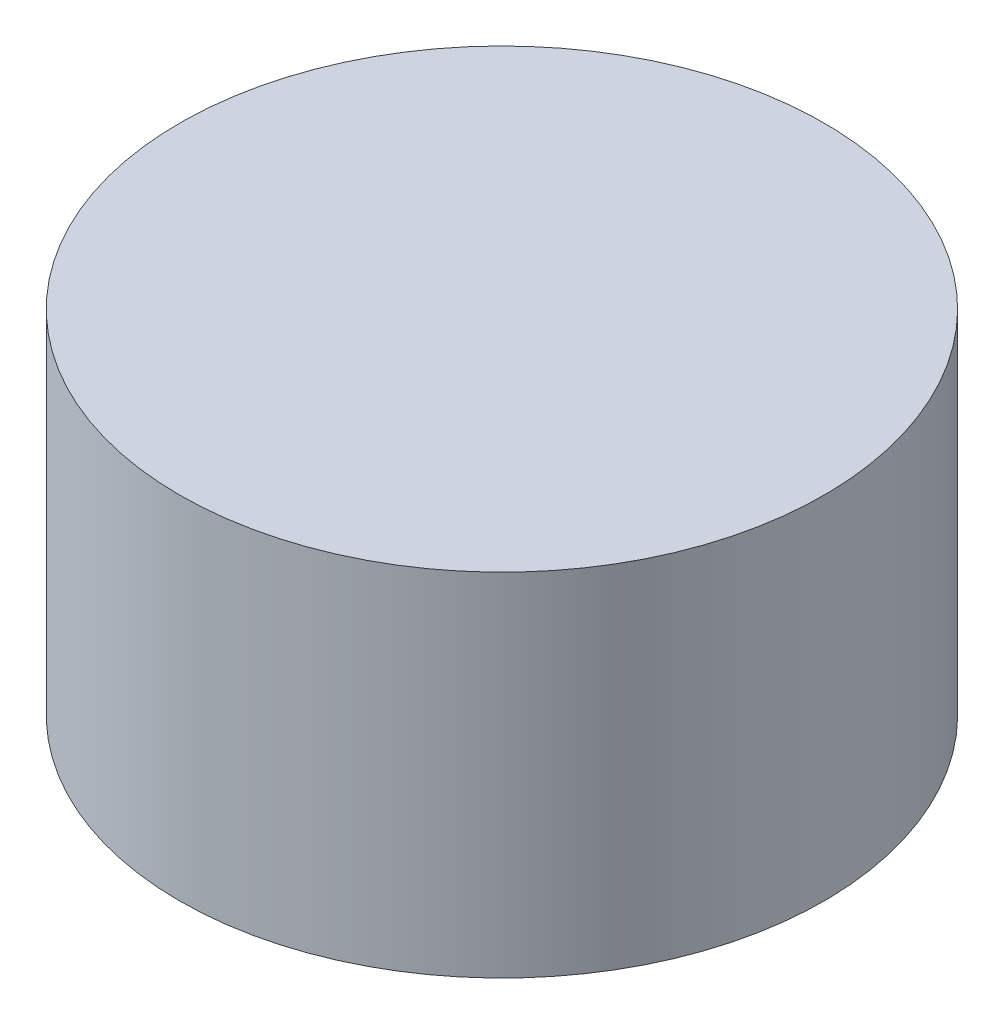
ISO-10303-21;
HEADER;
FILE_DESCRIPTION(('STEP AP214'),'2;1');
FILE_NAME('part.step','',(''),(''),'','','');
FILE_SCHEMA(('AUTOMOTIVE_DESIGN { 1 0 10303 214 1 1 1 1 }'));
ENDSEC;
DATA;
#1=APPLICATION_CONTEXT('core data for automotive mechanical design processes');
#2=APPLICATION_PROTOCOL_DEFINITION('international standard','automotive_design',2000,#1);
#3=PRODUCT_CONTEXT('',#1,'mechanical');
#4=PRODUCT('Part','Part','',(#3));
#5=PRODUCT_RELATED_PRODUCT_CATEGORY('part','',(#4));
#6=PRODUCT_DEFINITION_FORMATION('','',#4);
#7=PRODUCT_DEFINITION_CONTEXT('part definition',#1,'design');
#8=PRODUCT_DEFINITION('design','',#6,#7);
#9=PRODUCT_DEFINITION_SHAPE('','',#8);
#10=(LENGTH_UNIT() NAMED_UNIT(*) SI_UNIT(.MILLI.,.METRE.));
#11=(NAMED_UNIT(*) PLANE_ANGLE_UNIT() SI_UNIT($,.RADIAN.));
#12=(NAMED_UNIT(*) SI_UNIT($,.STERADIAN.) SOLID_ANGLE_UNIT());
#13=UNCERTAINTY_MEASURE_WITH_UNIT(LENGTH_MEASURE(1.E-05),#10,'distance_accuracy_value','');
#14=(GEOMETRIC_REPRESENTATION_CONTEXT(3) GLOBAL_UNCERTAINTY_ASSIGNED_CONTEXT((#13)) GLOBAL_UNIT_ASSIGNED_CONTEXT((#10,
#11,#12)) REPRESENTATION_CONTEXT('',''));
#15=CARTESIAN_POINT('',(0.,0.,0.));
#16=DIRECTION('',(0.,0.,1.));
#17=DIRECTION('',(1.,0.,0.));
#18=AXIS2_PLACEMENT_3D('',#15,#16,#17);
#19=CARTESIAN_POINT('',(0.,9.525,0.));
#20=DIRECTION('',(0.,-1.,0.));
#21=DIRECTION('',(0.,0.,-1.));
#22=AXIS2_PLACEMENT_3D('',#19,#20,#21);
#23=CYLINDRICAL_SURFACE('',#22,8.73125);
#24=CARTESIAN_POINT('',(0.,9.525,0.));
#25=DIRECTION('',(0.,1.,0.));
#26=DIRECTION('',(0.,0.,1.));
#27=AXIS2_PLACEMENT_3D('',#24,#25,#26);
#28=CIRCLE('',#27,8.73125);
#29=CARTESIAN_POINT('',(0.,9.525,8.73125));
#30=VERTEX_POINT('',#29);
#31=EDGE_CURVE('E10',#30,#30,#28,.T.);
#32=ORIENTED_EDGE('',*,*,#31,.F.);
#33=EDGE_LOOP('',(#32));
#34=FACE_BOUND('',#33,.T.);
#35=CARTESIAN_POINT('',(0.,0.,0.));
#36=DIRECTION('',(0.,1.,0.));
#37=DIRECTION('',(0.,0.,1.));
#38=AXIS2_PLACEMENT_3D('',#35,#36,#37);
#39=CIRCLE('',#38,8.73125);
#40=CARTESIAN_POINT('',(0.,0.,8.73125));
#41=VERTEX_POINT('',#40);
#42=EDGE_CURVE('E38',#41,#41,#39,.T.);
#43=ORIENTED_EDGE('',*,*,#42,.T.);
#44=EDGE_LOOP('',(#43));
#45=FACE_BOUND('',#44,.T.);
#46=ADVANCED_FACE('F35',(#34,#45),#23,.T.);
#47=CARTESIAN_POINT('',(0.,9.525,0.));
#48=DIRECTION('',(0.,1.,0.));
#49=DIRECTION('',(0.,0.,1.));
#50=AXIS2_PLACEMENT_3D('',#47,#48,#49);
#51=PLANE('',#50);
#52=ORIENTED_EDGE('',*,*,#31,.T.);
#53=EDGE_LOOP('',(#52));
#54=FACE_BOUND('',#53,.T.);
#55=ADVANCED_FACE('F50',(#54),#51,.T.);
#56=CARTESIAN_POINT('',(0.,0.,0.));
#57=DIRECTION('',(0.,1.,0.));
#58=DIRECTION('',(0.,0.,1.));
#59=AXIS2_PLACEMENT_3D('',#56,#57,#58);
#60=PLANE('',#59);
#61=ORIENTED_EDGE('',*,*,#42,.F.);
#62=EDGE_LOOP('',(#61));
#63=FACE_BOUND('',#62,.T.);
#64=ADVANCED_FACE('F48',(#63),#60,.F.);
#65=CLOSED_SHELL('',(#46,#55,#64));
#66=MANIFOLD_SOLID_BREP('B2',#65);
#67=ADVANCED_BREP_SHAPE_REPRESENTATION('',(#18,#66),#14);
#68=SHAPE_DEFINITION_REPRESENTATION(#9,#67);
ENDSEC;
END-ISO-10303-21;
